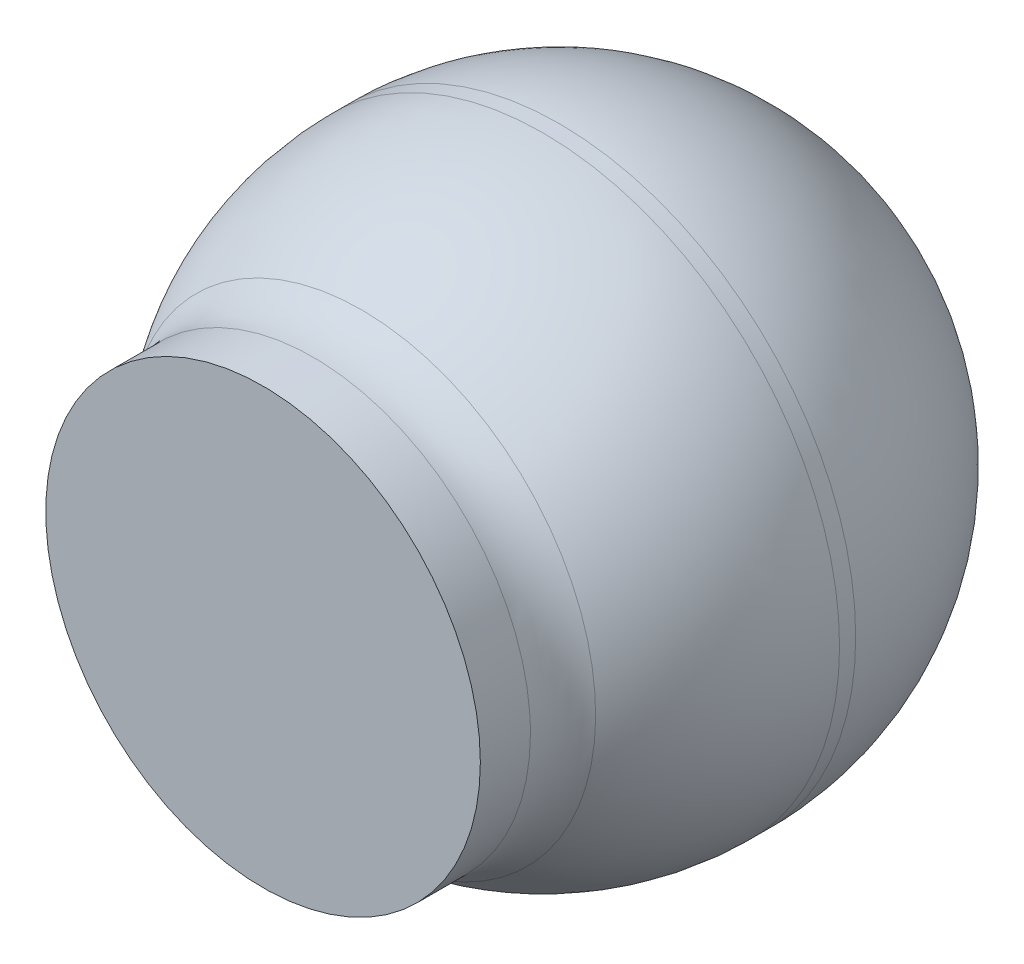
ISO-10303-21;
HEADER;
FILE_DESCRIPTION(('STEP AP214'),'2;1');
FILE_NAME('part.step','',(''),(''),'','','');
FILE_SCHEMA(('AUTOMOTIVE_DESIGN { 1 0 10303 214 1 1 1 1 }'));
ENDSEC;
DATA;
#1=APPLICATION_CONTEXT('core data for automotive mechanical design processes');
#2=APPLICATION_PROTOCOL_DEFINITION('international standard','automotive_design',2000,#1);
#3=PRODUCT_CONTEXT('',#1,'mechanical');
#4=PRODUCT('Part','Part','',(#3));
#5=PRODUCT_RELATED_PRODUCT_CATEGORY('part','',(#4));
#6=PRODUCT_DEFINITION_FORMATION('','',#4);
#7=PRODUCT_DEFINITION_CONTEXT('part definition',#1,'design');
#8=PRODUCT_DEFINITION('design','',#6,#7);
#9=PRODUCT_DEFINITION_SHAPE('','',#8);
#10=(LENGTH_UNIT() NAMED_UNIT(*) SI_UNIT(.MILLI.,.METRE.));
#11=(NAMED_UNIT(*) PLANE_ANGLE_UNIT() SI_UNIT($,.RADIAN.));
#12=(NAMED_UNIT(*) SI_UNIT($,.STERADIAN.) SOLID_ANGLE_UNIT());
#13=UNCERTAINTY_MEASURE_WITH_UNIT(LENGTH_MEASURE(1.E-05),#10,'distance_accuracy_value','');
#14=(GEOMETRIC_REPRESENTATION_CONTEXT(3) GLOBAL_UNCERTAINTY_ASSIGNED_CONTEXT((#13)) GLOBAL_UNIT_ASSIGNED_CONTEXT((#10,
#11,#12)) REPRESENTATION_CONTEXT('',''));
#15=CARTESIAN_POINT('',(0.,0.,0.));
#16=DIRECTION('',(0.,0.,1.));
#17=DIRECTION('',(1.,0.,0.));
#18=AXIS2_PLACEMENT_3D('',#15,#16,#17);
#19=CARTESIAN_POINT('',(-8.182919922269,-6.591349291452,10.006534503384));
#20=DIRECTION('',(0.,0.,-1.));
#21=DIRECTION('',(-1.,0.,0.));
#22=AXIS2_PLACEMENT_3D('',#19,#20,#21);
#23=PLANE('',#22);
#24=CARTESIAN_POINT('',(-8.182919922269,-6.591349291452,10.006534503384));
#25=DIRECTION('',(0.,0.,1.));
#26=DIRECTION('',(1.,0.,0.));
#27=AXIS2_PLACEMENT_3D('',#24,#25,#26);
#28=CIRCLE('',#27,0.275);
#29=CARTESIAN_POINT('',(-7.907919922269,-6.591349291452,10.006534503384));
#30=VERTEX_POINT('',#29);
#31=EDGE_CURVE('E20',#30,#30,#28,.F.);
#32=ORIENTED_EDGE('',*,*,#31,.F.);
#33=EDGE_LOOP('',(#32));
#34=FACE_BOUND('',#33,.T.);
#35=ADVANCED_FACE('F17',(#34),#23,.F.);
#36=CARTESIAN_POINT('',(-8.182919922269,-6.591349291452,9.906534503384));
#37=DIRECTION('',(0.,0.,1.));
#38=DIRECTION('',(1.,0.,0.));
#39=AXIS2_PLACEMENT_3D('',#36,#37,#38);
#40=CYLINDRICAL_SURFACE('',#39,0.275);
#41=CARTESIAN_POINT('',(-8.182919922269,-6.591349291452,9.943180457728));
#42=DIRECTION('',(0.,0.,-1.));
#43=DIRECTION('',(0.996700902337583,0.0811622527992436,0.));
#44=AXIS2_PLACEMENT_3D('',#41,#42,#43);
#45=CIRCLE('',#44,0.275000000000001);
#46=CARTESIAN_POINT('',(-7.90882717412616,-6.56902967193221,9.943180457728));
#47=VERTEX_POINT('',#46);
#48=EDGE_CURVE('E65',#47,#47,#45,.F.);
#49=ORIENTED_EDGE('',*,*,#48,.T.);
#50=EDGE_LOOP('',(#49));
#51=FACE_BOUND('',#50,.T.);
#52=ORIENTED_EDGE('',*,*,#31,.T.);
#53=EDGE_LOOP('',(#52));
#54=FACE_BOUND('',#53,.T.);
#55=ADVANCED_FACE('F62',(#51,#54),#40,.T.);
#56=CARTESIAN_POINT('',(-8.182919922269,-6.591349291452,9.943180457728));
#57=DIRECTION('',(0.,0.,-1.));
#58=DIRECTION('',(0.996700902337583,0.0811622527992448,0.));
#59=AXIS2_PLACEMENT_3D('',#56,#57,#58);
#60=TOROIDAL_SURFACE('',#59,0.375,0.1);
#61=ORIENTED_EDGE('',*,*,#48,.F.);
#62=EDGE_LOOP('',(#61));
#63=FACE_BOUND('',#62,.T.);
#64=CARTESIAN_POINT('',(-8.182919922269,-6.591349291452,9.881744931236));
#65=DIRECTION('',(0.,0.,-1.));
#66=DIRECTION('',(-0.996700902337598,-0.0811622527990598,0.));
#67=AXIS2_PLACEMENT_3D('',#64,#65,#66);
#68=CIRCLE('',#67,0.296097046412663);
#69=CARTESIAN_POINT('',(-8.478040115608,-6.615381194786,9.881744931236));
#70=VERTEX_POINT('',#69);
#71=EDGE_CURVE('E39',#70,#70,#68,.T.);
#72=ORIENTED_EDGE('',*,*,#71,.F.);
#73=EDGE_LOOP('',(#72));
#74=FACE_BOUND('',#73,.T.);
#75=ADVANCED_FACE('F57',(#63,#74),#60,.F.);
#76=CARTESIAN_POINT('',(-8.556682760645,-6.621785136252,9.651976062157));
#77=CARTESIAN_POINT('',(-8.556682760645,-6.621785136252,9.701461392103));
#78=CARTESIAN_POINT('',(-8.548526217348,-6.621120941579,9.750947004335));
#79=CARTESIAN_POINT('',(-8.532207085349,-6.619792059952,9.798626332798));
#80=CARTESIAN_POINT('',(-8.508341390838,-6.617848654938,9.842699544317));
#81=CARTESIAN_POINT('',(-8.478040115608,-6.615381194786,9.881744931236));
#82=(BOUNDED_CURVE() B_SPLINE_CURVE(5,(#76,#77,#78,#79,#80,#81),.UNSPECIFIED.,.F.,
.F.) B_SPLINE_CURVE_WITH_KNOTS((6,6),(0.,0.661568582165),
.UNSPECIFIED.) CURVE() GEOMETRIC_REPRESENTATION_ITEM() RATIONAL_B_SPLINE_CURVE((1.,1.,1.,1.,1.,1.)) REPRESENTATION_ITEM(''));
#83=CARTESIAN_POINT('',(-8.182919922269,-6.591349291452,9.651976062157));
#84=DIRECTION('',(0.,0.,-1.));
#85=AXIS1_PLACEMENT('',#83,#84);
#86=SURFACE_OF_REVOLUTION('',#82,#85);
#87=CARTESIAN_POINT('',(-8.182919922269,-6.591349291452,9.651976062157));
#88=DIRECTION('',(0.,0.,1.));
#89=DIRECTION('',(1.,0.,0.));
#90=AXIS2_PLACEMENT_3D('',#87,#88,#89);
#91=CIRCLE('',#90,0.375);
#92=CARTESIAN_POINT('',(-7.807919922269,-6.591349291452,9.651976062157));
#93=VERTEX_POINT('',#92);
#94=EDGE_CURVE('E36',#93,#93,#91,.F.);
#95=ORIENTED_EDGE('',*,*,#94,.F.);
#96=EDGE_LOOP('',(#95));
#97=FACE_BOUND('',#96,.T.);
#98=ORIENTED_EDGE('',*,*,#71,.T.);
#99=EDGE_LOOP('',(#98));
#100=FACE_BOUND('',#99,.T.);
#101=ADVANCED_FACE('F53',(#97,#100),#86,.F.);
#102=CARTESIAN_POINT('',(-8.182919922269,-6.591349291452,9.256534503384));
#103=DIRECTION('',(0.,0.,1.));
#104=DIRECTION('',(1.,0.,0.));
#105=AXIS2_PLACEMENT_3D('',#102,#103,#104);
#106=CYLINDRICAL_SURFACE('',#105,0.375);
#107=CARTESIAN_POINT('',(-8.182919922269,-6.591349291452,9.631534503384));
#108=DIRECTION('',(0.,0.,-1.));
#109=DIRECTION('',(0.0811622527992357,-0.996700902337583,0.));
#110=AXIS2_PLACEMENT_3D('',#107,#108,#109);
#111=CIRCLE('',#110,0.375);
#112=CARTESIAN_POINT('',(-8.15248407746929,-6.96511212982859,9.631534503384));
#113=VERTEX_POINT('',#112);
#114=CARTESIAN_POINT('',(-8.21335576706871,-6.21758645307541,9.631534503384));
#115=VERTEX_POINT('',#114);
#116=EDGE_CURVE('E11',#113,#115,#111,.T.);
#117=ORIENTED_EDGE('',*,*,#116,.F.);
#118=CARTESIAN_POINT('',(-8.182919922269,-6.591349291452,9.631534503384));
#119=DIRECTION('',(0.,0.,1.));
#120=DIRECTION('',(0.0811622527992365,-0.996700902337583,0.));
#121=AXIS2_PLACEMENT_3D('',#118,#119,#120);
#122=CIRCLE('',#121,0.375);
#123=EDGE_CURVE('E25',#115,#113,#122,.F.);
#124=ORIENTED_EDGE('',*,*,#123,.F.);
#125=EDGE_LOOP('',(#117,#124));
#126=FACE_BOUND('',#125,.T.);
#127=ORIENTED_EDGE('',*,*,#94,.T.);
#128=EDGE_LOOP('',(#127));
#129=FACE_BOUND('',#128,.T.);
#130=ADVANCED_FACE('F34',(#126,#129),#106,.T.);
#131=CARTESIAN_POINT('',(-8.182919922269,-6.591349291452,9.631534503384));
#132=DIRECTION('',(0.0811622527992361,-0.996700902337583,0.));
#133=DIRECTION('',(-0.996700902337583,-0.0811622527992361,0.));
#134=AXIS2_PLACEMENT_3D('',#131,#132,#133);
#135=SPHERICAL_SURFACE('',#134,0.375);
#136=ORIENTED_EDGE('',*,*,#123,.T.);
#137=ORIENTED_EDGE('',*,*,#116,.T.);
#138=EDGE_LOOP('',(#136,#137));
#139=FACE_BOUND('',#138,.T.);
#140=ADVANCED_FACE('F32',(#139),#135,.T.);
#141=CLOSED_SHELL('',(#35,#55,#75,#101,#130,#140));
#142=MANIFOLD_SOLID_BREP('B1',#141);
#143=ADVANCED_BREP_SHAPE_REPRESENTATION('',(#18,#142),#14);
#144=SHAPE_DEFINITION_REPRESENTATION(#9,#143);
ENDSEC;
END-ISO-10303-21;
